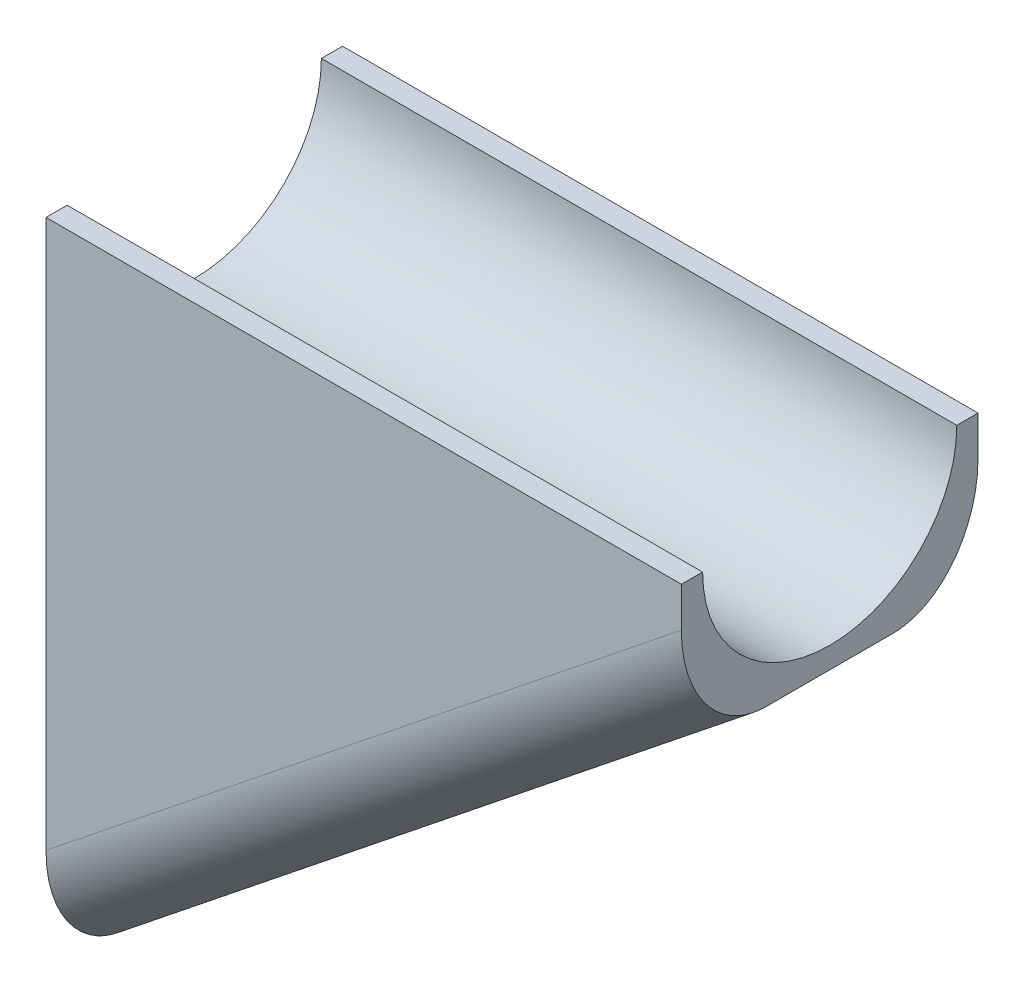
ISO-10303-21;
HEADER;
FILE_DESCRIPTION(('STEP AP214'),'2;1');
FILE_NAME('part.step','',(''),(''),'','','');
FILE_SCHEMA(('AUTOMOTIVE_DESIGN { 1 0 10303 214 1 1 1 1 }'));
ENDSEC;
DATA;
#1=APPLICATION_CONTEXT('core data for automotive mechanical design processes');
#2=APPLICATION_PROTOCOL_DEFINITION('international standard','automotive_design',2000,#1);
#3=PRODUCT_CONTEXT('',#1,'mechanical');
#4=PRODUCT('Part','Part','',(#3));
#5=PRODUCT_RELATED_PRODUCT_CATEGORY('part','',(#4));
#6=PRODUCT_DEFINITION_FORMATION('','',#4);
#7=PRODUCT_DEFINITION_CONTEXT('part definition',#1,'design');
#8=PRODUCT_DEFINITION('design','',#6,#7);
#9=PRODUCT_DEFINITION_SHAPE('','',#8);
#10=(LENGTH_UNIT() NAMED_UNIT(*) SI_UNIT(.MILLI.,.METRE.));
#11=(NAMED_UNIT(*) PLANE_ANGLE_UNIT() SI_UNIT($,.RADIAN.));
#12=(NAMED_UNIT(*) SI_UNIT($,.STERADIAN.) SOLID_ANGLE_UNIT());
#13=UNCERTAINTY_MEASURE_WITH_UNIT(LENGTH_MEASURE(1.E-05),#10,'distance_accuracy_value','');
#14=(GEOMETRIC_REPRESENTATION_CONTEXT(3) GLOBAL_UNCERTAINTY_ASSIGNED_CONTEXT((#13)) GLOBAL_UNIT_ASSIGNED_CONTEXT((#10,
#11,#12)) REPRESENTATION_CONTEXT('',''));
#15=CARTESIAN_POINT('',(0.,0.,0.));
#16=DIRECTION('',(0.,0.,1.));
#17=DIRECTION('',(1.,0.,0.));
#18=AXIS2_PLACEMENT_3D('',#15,#16,#17);
#19=CARTESIAN_POINT('',(0.,9.5,0.));
#20=DIRECTION('',(0.,1.,0.));
#21=DIRECTION('',(0.,0.,1.));
#22=AXIS2_PLACEMENT_3D('',#19,#20,#21);
#23=PLANE('',#22);
#24=DIRECTION('',(0.,0.,-1.));
#25=VECTOR('',#24,1.);
#26=CARTESIAN_POINT('',(7.5,9.5,0.));
#27=LINE('',#26,#25);
#28=CARTESIAN_POINT('',(7.5,9.5,7.));
#29=VERTEX_POINT('',#28);
#30=CARTESIAN_POINT('',(7.49999999999999,9.5,6.5));
#31=VERTEX_POINT('',#30);
#32=EDGE_CURVE('E126',#29,#31,#27,.T.);
#33=ORIENTED_EDGE('',*,*,#32,.T.);
#34=DIRECTION('',(-1.,0.,0.));
#35=VECTOR('',#34,1.);
#36=CARTESIAN_POINT('',(54.5963511761214,9.5,6.5));
#37=LINE('',#36,#35);
#38=CARTESIAN_POINT('',(-7.5,9.5,6.5));
#39=VERTEX_POINT('',#38);
#40=EDGE_CURVE('E139',#31,#39,#37,.T.);
#41=ORIENTED_EDGE('',*,*,#40,.T.);
#42=DIRECTION('',(0.,0.,1.));
#43=VECTOR('',#42,1.);
#44=CARTESIAN_POINT('',(-7.5,9.5,0.));
#45=LINE('',#44,#43);
#46=CARTESIAN_POINT('',(-7.5,9.5,7.));
#47=VERTEX_POINT('',#46);
#48=EDGE_CURVE('E209',#39,#47,#45,.T.);
#49=ORIENTED_EDGE('',*,*,#48,.T.);
#50=DIRECTION('',(1.,0.,0.));
#51=VECTOR('',#50,1.);
#52=CARTESIAN_POINT('',(-7.5,9.5,7.));
#53=LINE('',#52,#51);
#54=EDGE_CURVE('E127',#47,#29,#53,.T.);
#55=ORIENTED_EDGE('',*,*,#54,.T.);
#56=EDGE_LOOP('',(#33,#41,#49,#55));
#57=FACE_BOUND('',#56,.T.);
#58=ADVANCED_FACE('F45',(#57),#23,.T.);
#59=CARTESIAN_POINT('',(-7.5,6.,7.));
#60=DIRECTION('',(1.,0.,0.));
#61=DIRECTION('',(0.,1.,0.));
#62=AXIS2_PLACEMENT_3D('',#59,#60,#61);
#63=PLANE('',#62);
#64=DIRECTION('',(0.,-1.,0.));
#65=VECTOR('',#64,1.);
#66=CARTESIAN_POINT('',(-7.5,6.,0.));
#67=LINE('',#66,#65);
#68=CARTESIAN_POINT('',(-7.5,9.5,0.));
#69=VERTEX_POINT('',#68);
#70=CARTESIAN_POINT('',(-7.5,-3.43875030502686,0.));
#71=VERTEX_POINT('',#70);
#72=EDGE_CURVE('E171',#69,#71,#67,.T.);
#73=ORIENTED_EDGE('',*,*,#72,.T.);
#74=CARTESIAN_POINT('',(-7.5,-3.43875030502686,2.));
#75=DIRECTION('',(1.,0.,0.));
#76=DIRECTION('',(0.,-1.,0.));
#77=AXIS2_PLACEMENT_3D('',#74,#75,#76);
#78=ELLIPSE('',#77,2.56124969497314,2.);
#79=CARTESIAN_POINT('',(-7.5,-6.,2.));
#80=VERTEX_POINT('',#79);
#81=EDGE_CURVE('E54',#71,#80,#78,.F.);
#82=ORIENTED_EDGE('',*,*,#81,.T.);
#83=DIRECTION('',(0.,0.,-1.));
#84=VECTOR('',#83,1.);
#85=CARTESIAN_POINT('',(-7.5,-6.,7.));
#86=LINE('',#85,#84);
#87=CARTESIAN_POINT('',(-7.5,-6.,5.));
#88=VERTEX_POINT('',#87);
#89=EDGE_CURVE('E145',#88,#80,#86,.T.);
#90=ORIENTED_EDGE('',*,*,#89,.F.);
#91=CARTESIAN_POINT('',(-7.5,-3.43875030502686,5.));
#92=DIRECTION('',(1.,0.,0.));
#93=DIRECTION('',(0.,1.,0.));
#94=AXIS2_PLACEMENT_3D('',#91,#92,#93);
#95=ELLIPSE('',#94,2.56124969497314,2.);
#96=CARTESIAN_POINT('',(-7.5,-3.43875030502686,7.));
#97=VERTEX_POINT('',#96);
#98=EDGE_CURVE('E61',#88,#97,#95,.F.);
#99=ORIENTED_EDGE('',*,*,#98,.T.);
#100=DIRECTION('',(0.,-1.,0.));
#101=VECTOR('',#100,1.);
#102=CARTESIAN_POINT('',(-7.5,6.,7.));
#103=LINE('',#102,#101);
#104=EDGE_CURVE('E190',#47,#97,#103,.T.);
#105=ORIENTED_EDGE('',*,*,#104,.F.);
#106=ORIENTED_EDGE('',*,*,#48,.F.);
#107=CARTESIAN_POINT('',(-7.5,9.5,3.5));
#108=DIRECTION('',(1.,0.,0.));
#109=DIRECTION('',(0.,1.,0.));
#110=AXIS2_PLACEMENT_3D('',#107,#108,#109);
#111=CIRCLE('',#110,3.);
#112=CARTESIAN_POINT('',(-7.5,9.5,0.5));
#113=VERTEX_POINT('',#112);
#114=EDGE_CURVE('E138',#113,#39,#111,.F.);
#115=ORIENTED_EDGE('',*,*,#114,.F.);
#116=EDGE_CURVE('E134',#69,#113,#45,.T.);
#117=ORIENTED_EDGE('',*,*,#116,.F.);
#118=EDGE_LOOP('',(#73,#82,#90,#99,#105,#106,#115,#117));
#119=FACE_BOUND('',#118,.T.);
#120=ADVANCED_FACE('F170',(#119),#63,.F.);
#121=CARTESIAN_POINT('',(-7.5,-6.,7.));
#122=DIRECTION('',(-0.624695047554425,0.78086880944303,0.));
#123=DIRECTION('',(-0.78086880944303,-0.624695047554425,0.));
#124=AXIS2_PLACEMENT_3D('',#121,#122,#123);
#125=PLANE('',#124);
#126=ORIENTED_EDGE('',*,*,#89,.T.);
#127=DIRECTION('',(0.78086880944303,0.624695047554425,0.));
#128=VECTOR('',#127,1.);
#129=CARTESIAN_POINT('',(7.5,6.,2.));
#130=LINE('',#129,#128);
#131=CARTESIAN_POINT('',(7.5,6.,2.));
#132=VERTEX_POINT('',#131);
#133=EDGE_CURVE('E149',#80,#132,#130,.T.);
#134=ORIENTED_EDGE('',*,*,#133,.T.);
#135=DIRECTION('',(0.,0.,-1.));
#136=VECTOR('',#135,1.);
#137=CARTESIAN_POINT('',(7.5,6.,7.));
#138=LINE('',#137,#136);
#139=CARTESIAN_POINT('',(7.5,6.,5.));
#140=VERTEX_POINT('',#139);
#141=EDGE_CURVE('E152',#140,#132,#138,.T.);
#142=ORIENTED_EDGE('',*,*,#141,.F.);
#143=DIRECTION('',(0.78086880944303,0.624695047554425,0.));
#144=VECTOR('',#143,1.);
#145=CARTESIAN_POINT('',(-7.5,-6.,5.));
#146=LINE('',#145,#144);
#147=EDGE_CURVE('E144',#140,#88,#146,.F.);
#148=ORIENTED_EDGE('',*,*,#147,.T.);
#149=EDGE_LOOP('',(#126,#134,#142,#148));
#150=FACE_BOUND('',#149,.T.);
#151=ADVANCED_FACE('F175',(#150),#125,.F.);
#152=CARTESIAN_POINT('',(0.,0.,7.));
#153=DIRECTION('',(0.,0.,-1.));
#154=DIRECTION('',(-1.,0.,0.));
#155=AXIS2_PLACEMENT_3D('',#152,#153,#154);
#156=PLANE('',#155);
#157=ORIENTED_EDGE('',*,*,#104,.T.);
#158=DIRECTION('',(0.78086880944303,0.624695047554425,0.));
#159=VECTOR('',#158,1.);
#160=CARTESIAN_POINT('',(-1.24939009510885,1.56173761888606,7.));
#161=LINE('',#160,#159);
#162=CARTESIAN_POINT('',(7.5,8.56124969497314,7.));
#163=VERTEX_POINT('',#162);
#164=EDGE_CURVE('E11',#97,#163,#161,.T.);
#165=ORIENTED_EDGE('',*,*,#164,.T.);
#166=DIRECTION('',(0.,-1.,0.));
#167=VECTOR('',#166,1.);
#168=CARTESIAN_POINT('',(7.5,9.5,7.));
#169=LINE('',#168,#167);
#170=EDGE_CURVE('E182',#29,#163,#169,.T.);
#171=ORIENTED_EDGE('',*,*,#170,.F.);
#172=ORIENTED_EDGE('',*,*,#54,.F.);
#173=EDGE_LOOP('',(#157,#165,#171,#172));
#174=FACE_BOUND('',#173,.T.);
#175=ADVANCED_FACE('F198',(#174),#156,.F.);
#176=CARTESIAN_POINT('',(0.,0.,0.));
#177=DIRECTION('',(0.,0.,-1.));
#178=DIRECTION('',(-1.,0.,0.));
#179=AXIS2_PLACEMENT_3D('',#176,#177,#178);
#180=PLANE('',#179);
#181=DIRECTION('',(0.,-1.,0.));
#182=VECTOR('',#181,1.);
#183=CARTESIAN_POINT('',(7.5,9.5,0.));
#184=LINE('',#183,#182);
#185=CARTESIAN_POINT('',(7.5,9.5,0.));
#186=VERTEX_POINT('',#185);
#187=CARTESIAN_POINT('',(7.5,8.56124969497314,0.));
#188=VERTEX_POINT('',#187);
#189=EDGE_CURVE('E121',#186,#188,#184,.T.);
#190=ORIENTED_EDGE('',*,*,#189,.T.);
#191=DIRECTION('',(0.78086880944303,0.624695047554425,0.));
#192=VECTOR('',#191,1.);
#193=CARTESIAN_POINT('',(-8.74939009510885,-4.43826238111394,0.));
#194=LINE('',#193,#192);
#195=EDGE_CURVE('E69',#188,#71,#194,.F.);
#196=ORIENTED_EDGE('',*,*,#195,.T.);
#197=ORIENTED_EDGE('',*,*,#72,.F.);
#198=DIRECTION('',(-1.,0.,0.));
#199=VECTOR('',#198,1.);
#200=CARTESIAN_POINT('',(-7.5,9.5,0.));
#201=LINE('',#200,#199);
#202=EDGE_CURVE('E180',#186,#69,#201,.T.);
#203=ORIENTED_EDGE('',*,*,#202,.F.);
#204=EDGE_LOOP('',(#190,#196,#197,#203));
#205=FACE_BOUND('',#204,.T.);
#206=ADVANCED_FACE('F179',(#205),#180,.T.);
#207=CARTESIAN_POINT('',(7.5,9.5,0.));
#208=DIRECTION('',(-1.,0.,0.));
#209=DIRECTION('',(0.,0.,1.));
#210=AXIS2_PLACEMENT_3D('',#207,#208,#209);
#211=PLANE('',#210);
#212=ORIENTED_EDGE('',*,*,#141,.T.);
#213=CARTESIAN_POINT('',(7.5,8.56124969497314,2.));
#214=DIRECTION('',(-1.,0.,0.));
#215=DIRECTION('',(0.,-1.,0.));
#216=AXIS2_PLACEMENT_3D('',#213,#214,#215);
#217=ELLIPSE('',#216,2.56124969497314,2.);
#218=EDGE_CURVE('E162',#132,#188,#217,.F.);
#219=ORIENTED_EDGE('',*,*,#218,.T.);
#220=ORIENTED_EDGE('',*,*,#189,.F.);
#221=CARTESIAN_POINT('',(7.49999999999999,9.5,0.5));
#222=VERTEX_POINT('',#221);
#223=EDGE_CURVE('E113',#222,#186,#27,.T.);
#224=ORIENTED_EDGE('',*,*,#223,.F.);
#225=CARTESIAN_POINT('',(7.49999999999999,9.5,3.5));
#226=DIRECTION('',(-1.,0.,0.));
#227=DIRECTION('',(0.,0.,1.));
#228=AXIS2_PLACEMENT_3D('',#225,#226,#227);
#229=CIRCLE('',#228,3.);
#230=EDGE_CURVE('E119',#31,#222,#229,.F.);
#231=ORIENTED_EDGE('',*,*,#230,.F.);
#232=ORIENTED_EDGE('',*,*,#32,.F.);
#233=ORIENTED_EDGE('',*,*,#170,.T.);
#234=CARTESIAN_POINT('',(7.5,8.56124969497314,5.));
#235=DIRECTION('',(-1.,0.,0.));
#236=DIRECTION('',(0.,1.,0.));
#237=AXIS2_PLACEMENT_3D('',#234,#235,#236);
#238=ELLIPSE('',#237,2.56124969497314,2.);
#239=EDGE_CURVE('E159',#163,#140,#238,.F.);
#240=ORIENTED_EDGE('',*,*,#239,.T.);
#241=EDGE_LOOP('',(#212,#219,#220,#224,#231,#232,#233,#240));
#242=FACE_BOUND('',#241,.T.);
#243=ADVANCED_FACE('F116',(#242),#211,.F.);
#244=DIRECTION('',(-1.,0.,0.));
#245=VECTOR('',#244,1.);
#246=CARTESIAN_POINT('',(54.5963511761214,9.5,0.5));
#247=LINE('',#246,#245);
#248=EDGE_CURVE('E131',#222,#113,#247,.T.);
#249=ORIENTED_EDGE('',*,*,#248,.F.);
#250=ORIENTED_EDGE('',*,*,#223,.T.);
#251=ORIENTED_EDGE('',*,*,#202,.T.);
#252=ORIENTED_EDGE('',*,*,#116,.T.);
#253=EDGE_LOOP('',(#249,#250,#251,#252));
#254=FACE_BOUND('',#253,.T.);
#255=ADVANCED_FACE('F132',(#254),#23,.T.);
#256=CARTESIAN_POINT('',(54.5963511761214,9.5,3.5));
#257=DIRECTION('',(-1.,0.,0.));
#258=DIRECTION('',(0.,0.,1.));
#259=AXIS2_PLACEMENT_3D('',#256,#257,#258);
#260=CYLINDRICAL_SURFACE('',#259,3.);
#261=ORIENTED_EDGE('',*,*,#248,.T.);
#262=ORIENTED_EDGE('',*,*,#114,.T.);
#263=ORIENTED_EDGE('',*,*,#40,.F.);
#264=ORIENTED_EDGE('',*,*,#230,.T.);
#265=EDGE_LOOP('',(#261,#262,#263,#264));
#266=FACE_BOUND('',#265,.T.);
#267=ADVANCED_FACE('F142',(#266),#260,.F.);
#268=CARTESIAN_POINT('',(-8.74939009510885,-4.43826238111394,2.));
#269=DIRECTION('',(-0.78086880944303,-0.624695047554425,0.));
#270=DIRECTION('',(0.624695047554425,-0.78086880944303,0.));
#271=AXIS2_PLACEMENT_3D('',#268,#269,#270);
#272=CYLINDRICAL_SURFACE('',#271,2.);
#273=ORIENTED_EDGE('',*,*,#81,.F.);
#274=ORIENTED_EDGE('',*,*,#195,.F.);
#275=ORIENTED_EDGE('',*,*,#218,.F.);
#276=ORIENTED_EDGE('',*,*,#133,.F.);
#277=EDGE_LOOP('',(#273,#274,#275,#276));
#278=FACE_BOUND('',#277,.T.);
#279=ADVANCED_FACE('F178',(#278),#272,.T.);
#280=CARTESIAN_POINT('',(-1.24939009510885,1.56173761888606,5.));
#281=DIRECTION('',(0.78086880944303,0.624695047554425,0.));
#282=DIRECTION('',(-0.624695047554425,0.78086880944303,0.));
#283=AXIS2_PLACEMENT_3D('',#280,#281,#282);
#284=CYLINDRICAL_SURFACE('',#283,2.);
#285=ORIENTED_EDGE('',*,*,#98,.F.);
#286=ORIENTED_EDGE('',*,*,#147,.F.);
#287=ORIENTED_EDGE('',*,*,#239,.F.);
#288=ORIENTED_EDGE('',*,*,#164,.F.);
#289=EDGE_LOOP('',(#285,#286,#287,#288));
#290=FACE_BOUND('',#289,.T.);
#291=ADVANCED_FACE('F47',(#290),#284,.T.);
#292=CLOSED_SHELL('',(#58,#120,#151,#175,#206,#243,#255,#267,#279,#291));
#293=MANIFOLD_SOLID_BREP('B2',#292);
#294=ADVANCED_BREP_SHAPE_REPRESENTATION('',(#18,#293),#14);
#295=SHAPE_DEFINITION_REPRESENTATION(#9,#294);
ENDSEC;
END-ISO-10303-21;
